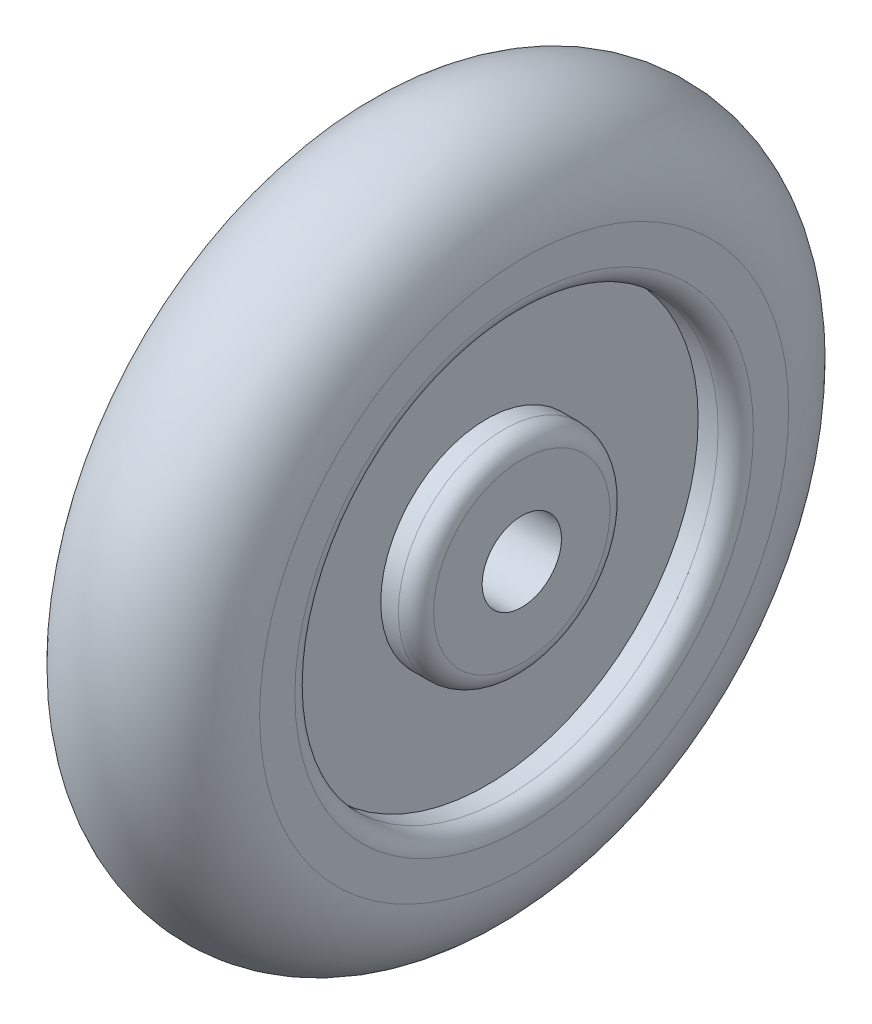
ISO-10303-21;
HEADER;
FILE_DESCRIPTION(('STEP AP214'),'2;1');
FILE_NAME('part.step','',(''),(''),'','','');
FILE_SCHEMA(('AUTOMOTIVE_DESIGN { 1 0 10303 214 1 1 1 1 }'));
ENDSEC;
DATA;
#1=APPLICATION_CONTEXT('core data for automotive mechanical design processes');
#2=APPLICATION_PROTOCOL_DEFINITION('international standard','automotive_design',2000,#1);
#3=PRODUCT_CONTEXT('',#1,'mechanical');
#4=PRODUCT('Part','Part','',(#3));
#5=PRODUCT_RELATED_PRODUCT_CATEGORY('part','',(#4));
#6=PRODUCT_DEFINITION_FORMATION('','',#4);
#7=PRODUCT_DEFINITION_CONTEXT('part definition',#1,'design');
#8=PRODUCT_DEFINITION('design','',#6,#7);
#9=PRODUCT_DEFINITION_SHAPE('','',#8);
#10=(LENGTH_UNIT() NAMED_UNIT(*) SI_UNIT(.MILLI.,.METRE.));
#11=(NAMED_UNIT(*) PLANE_ANGLE_UNIT() SI_UNIT($,.RADIAN.));
#12=(NAMED_UNIT(*) SI_UNIT($,.STERADIAN.) SOLID_ANGLE_UNIT());
#13=UNCERTAINTY_MEASURE_WITH_UNIT(LENGTH_MEASURE(1.E-05),#10,'distance_accuracy_value','');
#14=(GEOMETRIC_REPRESENTATION_CONTEXT(3) GLOBAL_UNCERTAINTY_ASSIGNED_CONTEXT((#13)) GLOBAL_UNIT_ASSIGNED_CONTEXT((#10,
#11,#12)) REPRESENTATION_CONTEXT('',''));
#15=CARTESIAN_POINT('',(0.,0.,0.));
#16=DIRECTION('',(0.,0.,1.));
#17=DIRECTION('',(1.,0.,0.));
#18=AXIS2_PLACEMENT_3D('',#15,#16,#17);
#19=CARTESIAN_POINT('',(7.06621067789101,6.,0.));
#20=DIRECTION('',(-1.,0.,0.));
#21=DIRECTION('',(0.,0.,1.));
#22=AXIS2_PLACEMENT_3D('',#19,#20,#21);
#23=PLANE('',#22);
#24=CARTESIAN_POINT('',(7.06621067789101,0.,0.));
#25=DIRECTION('',(-1.,0.,0.));
#26=DIRECTION('',(0.,0.,1.));
#27=AXIS2_PLACEMENT_3D('',#24,#25,#26);
#28=CIRCLE('',#27,5.);
#29=CARTESIAN_POINT('',(7.06621067789101,0.,5.));
#30=VERTEX_POINT('',#29);
#31=EDGE_CURVE('E46',#30,#30,#28,.F.);
#32=ORIENTED_EDGE('',*,*,#31,.T.);
#33=EDGE_LOOP('',(#32));
#34=FACE_BOUND('',#33,.T.);
#35=CARTESIAN_POINT('',(7.06621067789101,0.,0.));
#36=DIRECTION('',(-1.,0.,0.));
#37=DIRECTION('',(0.,0.,1.));
#38=AXIS2_PLACEMENT_3D('',#35,#36,#37);
#39=CIRCLE('',#38,2.25);
#40=CARTESIAN_POINT('',(7.06621067789101,0.,2.25));
#41=VERTEX_POINT('',#40);
#42=EDGE_CURVE('E86',#41,#41,#39,.T.);
#43=ORIENTED_EDGE('',*,*,#42,.T.);
#44=EDGE_LOOP('',(#43));
#45=FACE_BOUND('',#44,.T.);
#46=ADVANCED_FACE('F35',(#34,#45),#23,.F.);
#47=CARTESIAN_POINT('',(-6.69608440407621,0.,0.));
#48=DIRECTION('',(-1.,0.,0.));
#49=DIRECTION('',(0.,0.,1.));
#50=AXIS2_PLACEMENT_3D('',#47,#48,#49);
#51=CYLINDRICAL_SURFACE('',#50,6.);
#52=CARTESIAN_POINT('',(6.06621067789101,0.,0.));
#53=DIRECTION('',(-1.,0.,0.));
#54=DIRECTION('',(0.,0.,1.));
#55=AXIS2_PLACEMENT_3D('',#52,#53,#54);
#56=CIRCLE('',#55,6.);
#57=CARTESIAN_POINT('',(6.06621067789101,0.,6.));
#58=VERTEX_POINT('',#57);
#59=EDGE_CURVE('E50',#58,#58,#56,.T.);
#60=ORIENTED_EDGE('',*,*,#59,.T.);
#61=EDGE_LOOP('',(#60));
#62=FACE_BOUND('',#61,.T.);
#63=CARTESIAN_POINT('',(5.06621067789101,0.,0.));
#64=DIRECTION('',(-1.,0.,0.));
#65=DIRECTION('',(0.,0.,1.));
#66=AXIS2_PLACEMENT_3D('',#63,#64,#65);
#67=CIRCLE('',#66,6.);
#68=CARTESIAN_POINT('',(5.06621067789101,0.,6.));
#69=VERTEX_POINT('',#68);
#70=EDGE_CURVE('E74',#69,#69,#67,.T.);
#71=ORIENTED_EDGE('',*,*,#70,.F.);
#72=EDGE_LOOP('',(#71));
#73=FACE_BOUND('',#72,.T.);
#74=ADVANCED_FACE('F110',(#62,#73),#51,.T.);
#75=CARTESIAN_POINT('',(5.06621067789101,12.,0.));
#76=DIRECTION('',(-1.,0.,0.));
#77=DIRECTION('',(0.,0.,1.));
#78=AXIS2_PLACEMENT_3D('',#75,#76,#77);
#79=PLANE('',#78);
#80=CARTESIAN_POINT('',(5.06621067789101,0.,0.));
#81=DIRECTION('',(-1.,0.,0.));
#82=DIRECTION('',(0.,0.,1.));
#83=AXIS2_PLACEMENT_3D('',#80,#81,#82);
#84=CIRCLE('',#83,12.);
#85=CARTESIAN_POINT('',(5.06621067789101,0.,12.));
#86=VERTEX_POINT('',#85);
#87=EDGE_CURVE('E77',#86,#86,#84,.T.);
#88=ORIENTED_EDGE('',*,*,#87,.F.);
#89=EDGE_LOOP('',(#88));
#90=FACE_BOUND('',#89,.T.);
#91=ORIENTED_EDGE('',*,*,#70,.T.);
#92=EDGE_LOOP('',(#91));
#93=FACE_BOUND('',#92,.T.);
#94=ADVANCED_FACE('F116',(#90,#93),#79,.F.);
#95=CARTESIAN_POINT('',(-6.69608440407621,0.,0.));
#96=DIRECTION('',(-1.,0.,0.));
#97=DIRECTION('',(0.,0.,1.));
#98=AXIS2_PLACEMENT_3D('',#95,#96,#97);
#99=CYLINDRICAL_SURFACE('',#98,12.);
#100=CARTESIAN_POINT('',(6.19735821887461,0.,0.));
#101=DIRECTION('',(-1.,0.,0.));
#102=DIRECTION('',(0.,0.,1.));
#103=AXIS2_PLACEMENT_3D('',#100,#101,#102);
#104=CIRCLE('',#103,12.);
#105=CARTESIAN_POINT('',(6.19735821887461,0.,12.));
#106=VERTEX_POINT('',#105);
#107=EDGE_CURVE('E10',#106,#106,#104,.F.);
#108=ORIENTED_EDGE('',*,*,#107,.T.);
#109=EDGE_LOOP('',(#108));
#110=FACE_BOUND('',#109,.T.);
#111=ORIENTED_EDGE('',*,*,#87,.T.);
#112=EDGE_LOOP('',(#111));
#113=FACE_BOUND('',#112,.T.);
#114=ADVANCED_FACE('F150',(#110,#113),#99,.F.);
#115=CARTESIAN_POINT('',(7.19735821887461,15.,0.));
#116=DIRECTION('',(-1.,0.,0.));
#117=DIRECTION('',(0.,0.,1.));
#118=AXIS2_PLACEMENT_3D('',#115,#116,#117);
#119=PLANE('',#118);
#120=CARTESIAN_POINT('',(7.19735821887461,0.,0.));
#121=DIRECTION('',(-1.,0.,0.));
#122=DIRECTION('',(0.,0.,1.));
#123=AXIS2_PLACEMENT_3D('',#120,#121,#122);
#124=CIRCLE('',#123,13.);
#125=CARTESIAN_POINT('',(7.19735821887461,0.,13.));
#126=VERTEX_POINT('',#125);
#127=EDGE_CURVE('E42',#126,#126,#124,.T.);
#128=ORIENTED_EDGE('',*,*,#127,.T.);
#129=EDGE_LOOP('',(#128));
#130=FACE_BOUND('',#129,.T.);
#131=CARTESIAN_POINT('',(7.19735821887461,0.,0.));
#132=DIRECTION('',(-1.,0.,0.));
#133=DIRECTION('',(0.,0.,1.));
#134=AXIS2_PLACEMENT_3D('',#131,#132,#133);
#135=CIRCLE('',#134,15.);
#136=CARTESIAN_POINT('',(7.19735821887461,0.,15.));
#137=VERTEX_POINT('',#136);
#138=EDGE_CURVE('E80',#137,#137,#135,.T.);
#139=ORIENTED_EDGE('',*,*,#138,.F.);
#140=EDGE_LOOP('',(#139));
#141=FACE_BOUND('',#140,.T.);
#142=ADVANCED_FACE('F155',(#130,#141),#119,.F.);
#143=CARTESIAN_POINT('',(2.19735821887461,0.,0.));
#144=DIRECTION('',(-1.,0.,0.));
#145=DIRECTION('',(0.,0.,1.));
#146=AXIS2_PLACEMENT_3D('',#143,#144,#145);
#147=TOROIDAL_SURFACE('',#146,15.,5.);
#148=CARTESIAN_POINT('',(-2.80264178112539,0.,0.));
#149=DIRECTION('',(-1.,0.,0.));
#150=DIRECTION('',(0.,0.,1.));
#151=AXIS2_PLACEMENT_3D('',#148,#149,#150);
#152=CIRCLE('',#151,15.);
#153=CARTESIAN_POINT('',(-2.80264178112539,0.,15.));
#154=VERTEX_POINT('',#153);
#155=EDGE_CURVE('E83',#154,#154,#152,.T.);
#156=ORIENTED_EDGE('',*,*,#155,.F.);
#157=EDGE_LOOP('',(#156));
#158=FACE_BOUND('',#157,.T.);
#159=ORIENTED_EDGE('',*,*,#138,.T.);
#160=EDGE_LOOP('',(#159));
#161=FACE_BOUND('',#160,.T.);
#162=ADVANCED_FACE('F161',(#158,#161),#147,.T.);
#163=CARTESIAN_POINT('',(-2.80264178112539,12.,0.));
#164=DIRECTION('',(1.,0.,0.));
#165=DIRECTION('',(0.,0.,-1.));
#166=AXIS2_PLACEMENT_3D('',#163,#164,#165);
#167=PLANE('',#166);
#168=CARTESIAN_POINT('',(-2.80264178112539,0.,0.));
#169=DIRECTION('',(1.,0.,0.));
#170=DIRECTION('',(0.,0.,-1.));
#171=AXIS2_PLACEMENT_3D('',#168,#169,#170);
#172=CIRCLE('',#171,12.9956954483322);
#173=CARTESIAN_POINT('',(-2.80264178112539,0.,-12.9956954483322));
#174=VERTEX_POINT('',#173);
#175=EDGE_CURVE('E55',#174,#174,#172,.T.);
#176=ORIENTED_EDGE('',*,*,#175,.T.);
#177=EDGE_LOOP('',(#176));
#178=FACE_BOUND('',#177,.T.);
#179=ORIENTED_EDGE('',*,*,#155,.T.);
#180=EDGE_LOOP('',(#179));
#181=FACE_BOUND('',#180,.T.);
#182=ADVANCED_FACE('F106',(#178,#181),#167,.F.);
#183=CARTESIAN_POINT('',(-0.933789322108995,6.,0.));
#184=DIRECTION('',(1.,0.,0.));
#185=DIRECTION('',(0.,0.,-1.));
#186=AXIS2_PLACEMENT_3D('',#183,#184,#185);
#187=PLANE('',#186);
#188=CARTESIAN_POINT('',(-0.933789322108995,0.,0.));
#189=DIRECTION('',(1.,0.,0.));
#190=DIRECTION('',(0.,0.,-1.));
#191=AXIS2_PLACEMENT_3D('',#188,#189,#190);
#192=CIRCLE('',#191,11.);
#193=CARTESIAN_POINT('',(-0.933789322108995,0.,-11.));
#194=VERTEX_POINT('',#193);
#195=EDGE_CURVE('E68',#194,#194,#192,.F.);
#196=ORIENTED_EDGE('',*,*,#195,.T.);
#197=EDGE_LOOP('',(#196));
#198=FACE_BOUND('',#197,.T.);
#199=CARTESIAN_POINT('',(-0.933789322108995,0.,0.));
#200=DIRECTION('',(1.,0.,0.));
#201=DIRECTION('',(0.,0.,-1.));
#202=AXIS2_PLACEMENT_3D('',#199,#200,#201);
#203=CIRCLE('',#202,7.);
#204=CARTESIAN_POINT('',(-0.933789322108995,0.,-7.));
#205=VERTEX_POINT('',#204);
#206=EDGE_CURVE('E71',#205,#205,#203,.T.);
#207=ORIENTED_EDGE('',*,*,#206,.T.);
#208=EDGE_LOOP('',(#207));
#209=FACE_BOUND('',#208,.T.);
#210=ADVANCED_FACE('F97',(#198,#209),#187,.F.);
#211=CARTESIAN_POINT('',(-2.933789322109,0.,0.));
#212=DIRECTION('',(1.,0.,0.));
#213=DIRECTION('',(0.,0.,-1.));
#214=AXIS2_PLACEMENT_3D('',#211,#212,#213);
#215=PLANE('',#214);
#216=CARTESIAN_POINT('',(-2.933789322109,0.,0.));
#217=DIRECTION('',(1.,0.,0.));
#218=DIRECTION('',(0.,0.,-1.));
#219=AXIS2_PLACEMENT_3D('',#216,#217,#218);
#220=CIRCLE('',#219,5.);
#221=CARTESIAN_POINT('',(-2.933789322109,0.,-5.));
#222=VERTEX_POINT('',#221);
#223=EDGE_CURVE('E61',#222,#222,#220,.F.);
#224=ORIENTED_EDGE('',*,*,#223,.T.);
#225=EDGE_LOOP('',(#224));
#226=FACE_BOUND('',#225,.T.);
#227=CARTESIAN_POINT('',(-2.933789322109,0.,0.));
#228=DIRECTION('',(-1.,0.,0.));
#229=DIRECTION('',(0.,0.,1.));
#230=AXIS2_PLACEMENT_3D('',#227,#228,#229);
#231=CIRCLE('',#230,2.25);
#232=CARTESIAN_POINT('',(-2.933789322109,0.,2.25));
#233=VERTEX_POINT('',#232);
#234=EDGE_CURVE('E65',#233,#233,#231,.T.);
#235=ORIENTED_EDGE('',*,*,#234,.F.);
#236=EDGE_LOOP('',(#235));
#237=FACE_BOUND('',#236,.T.);
#238=ADVANCED_FACE('F95',(#226,#237),#215,.F.);
#239=CARTESIAN_POINT('',(7.19735821887461,0.,0.));
#240=DIRECTION('',(-1.,0.,0.));
#241=DIRECTION('',(0.,0.,1.));
#242=AXIS2_PLACEMENT_3D('',#239,#240,#241);
#243=CYLINDRICAL_SURFACE('',#242,2.25);
#244=ORIENTED_EDGE('',*,*,#234,.T.);
#245=EDGE_LOOP('',(#244));
#246=FACE_BOUND('',#245,.T.);
#247=ORIENTED_EDGE('',*,*,#42,.F.);
#248=EDGE_LOOP('',(#247));
#249=FACE_BOUND('',#248,.T.);
#250=ADVANCED_FACE('F92',(#246,#249),#243,.F.);
#251=CARTESIAN_POINT('',(-1.93378932210899,0.,0.));
#252=DIRECTION('',(1.,0.,0.));
#253=DIRECTION('',(0.,0.,-1.));
#254=AXIS2_PLACEMENT_3D('',#251,#252,#253);
#255=TOROIDAL_SURFACE('',#254,11.,1.);
#256=CARTESIAN_POINT('',(-1.86821555161719,0.,0.));
#257=DIRECTION('',(-1.,0.,0.));
#258=DIRECTION('',(0.,0.,1.));
#259=AXIS2_PLACEMENT_3D('',#256,#257,#258);
#260=CIRCLE('',#259,11.9978477241661);
#261=CARTESIAN_POINT('',(-1.86821555161719,0.,11.9978477241661));
#262=VERTEX_POINT('',#261);
#263=EDGE_CURVE('E58',#262,#262,#260,.T.);
#264=ORIENTED_EDGE('',*,*,#263,.T.);
#265=EDGE_LOOP('',(#264));
#266=FACE_BOUND('',#265,.T.);
#267=ORIENTED_EDGE('',*,*,#195,.F.);
#268=EDGE_LOOP('',(#267));
#269=FACE_BOUND('',#268,.T.);
#270=ADVANCED_FACE('F104',(#266,#269),#255,.F.);
#271=CARTESIAN_POINT('',(-1.93378932210899,0.,0.));
#272=DIRECTION('',(1.,0.,0.));
#273=DIRECTION('',(0.,0.,-1.));
#274=AXIS2_PLACEMENT_3D('',#271,#272,#273);
#275=TOROIDAL_SURFACE('',#274,5.,1.);
#276=ORIENTED_EDGE('',*,*,#223,.F.);
#277=EDGE_LOOP('',(#276));
#278=FACE_BOUND('',#277,.T.);
#279=CARTESIAN_POINT('',(-1.93378932210899,0.,0.));
#280=DIRECTION('',(1.,0.,0.));
#281=DIRECTION('',(0.,0.,-1.));
#282=AXIS2_PLACEMENT_3D('',#279,#280,#281);
#283=CIRCLE('',#282,6.);
#284=CARTESIAN_POINT('',(-1.93378932210899,0.,-6.));
#285=VERTEX_POINT('',#284);
#286=EDGE_CURVE('E62',#285,#285,#283,.T.);
#287=ORIENTED_EDGE('',*,*,#286,.F.);
#288=EDGE_LOOP('',(#287));
#289=FACE_BOUND('',#288,.T.);
#290=ADVANCED_FACE('F124',(#278,#289),#275,.T.);
#291=CARTESIAN_POINT('',(-1.93378932210899,0.,0.));
#292=DIRECTION('',(1.,0.,0.));
#293=DIRECTION('',(0.,0.,-1.));
#294=AXIS2_PLACEMENT_3D('',#291,#292,#293);
#295=TOROIDAL_SURFACE('',#294,7.,1.);
#296=ORIENTED_EDGE('',*,*,#206,.F.);
#297=EDGE_LOOP('',(#296));
#298=FACE_BOUND('',#297,.T.);
#299=ORIENTED_EDGE('',*,*,#286,.T.);
#300=EDGE_LOOP('',(#299));
#301=FACE_BOUND('',#300,.T.);
#302=ADVANCED_FACE('F126',(#298,#301),#295,.F.);
#303=CARTESIAN_POINT('',(-1.80264178112539,0.,0.));
#304=DIRECTION('',(1.,0.,0.));
#305=DIRECTION('',(0.,0.,-1.));
#306=AXIS2_PLACEMENT_3D('',#303,#304,#305);
#307=TOROIDAL_SURFACE('',#306,12.9956954483322,1.);
#308=ORIENTED_EDGE('',*,*,#175,.F.);
#309=EDGE_LOOP('',(#308));
#310=FACE_BOUND('',#309,.T.);
#311=ORIENTED_EDGE('',*,*,#263,.F.);
#312=EDGE_LOOP('',(#311));
#313=FACE_BOUND('',#312,.T.);
#314=ADVANCED_FACE('F129',(#310,#313),#307,.T.);
#315=CARTESIAN_POINT('',(6.06621067789101,0.,0.));
#316=DIRECTION('',(-1.,0.,0.));
#317=DIRECTION('',(0.,0.,1.));
#318=AXIS2_PLACEMENT_3D('',#315,#316,#317);
#319=TOROIDAL_SURFACE('',#318,5.,1.);
#320=ORIENTED_EDGE('',*,*,#31,.F.);
#321=EDGE_LOOP('',(#320));
#322=FACE_BOUND('',#321,.T.);
#323=ORIENTED_EDGE('',*,*,#59,.F.);
#324=EDGE_LOOP('',(#323));
#325=FACE_BOUND('',#324,.T.);
#326=ADVANCED_FACE('F135',(#322,#325),#319,.T.);
#327=CARTESIAN_POINT('',(6.19735821887461,0.,0.));
#328=DIRECTION('',(-1.,0.,0.));
#329=DIRECTION('',(0.,0.,1.));
#330=AXIS2_PLACEMENT_3D('',#327,#328,#329);
#331=TOROIDAL_SURFACE('',#330,13.,1.);
#332=ORIENTED_EDGE('',*,*,#107,.F.);
#333=EDGE_LOOP('',(#332));
#334=FACE_BOUND('',#333,.T.);
#335=ORIENTED_EDGE('',*,*,#127,.F.);
#336=EDGE_LOOP('',(#335));
#337=FACE_BOUND('',#336,.T.);
#338=ADVANCED_FACE('F37',(#334,#337),#331,.T.);
#339=CLOSED_SHELL('',(#46,#74,#94,#114,#142,#162,#182,#210,#238,#250,#270,#290,#302,#314,#326,#338));
#340=MANIFOLD_SOLID_BREP('B2',#339);
#341=ADVANCED_BREP_SHAPE_REPRESENTATION('',(#18,#340),#14);
#342=SHAPE_DEFINITION_REPRESENTATION(#9,#341);
ENDSEC;
END-ISO-10303-21;
